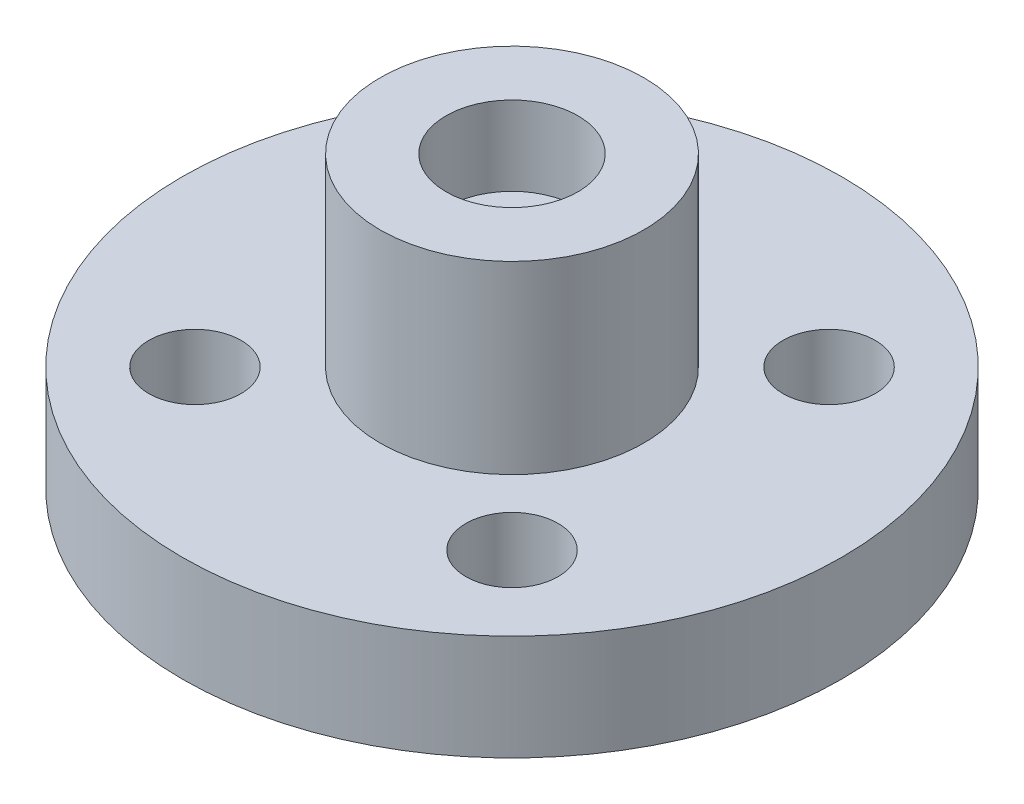
ISO-10303-21;
HEADER;
FILE_DESCRIPTION(('STEP AP214'),'2;1');
FILE_NAME('part.step','',(''),(''),'','','');
FILE_SCHEMA(('AUTOMOTIVE_DESIGN { 1 0 10303 214 1 1 1 1 }'));
ENDSEC;
DATA;
#1=APPLICATION_CONTEXT('core data for automotive mechanical design processes');
#2=APPLICATION_PROTOCOL_DEFINITION('international standard','automotive_design',2000,#1);
#3=PRODUCT_CONTEXT('',#1,'mechanical');
#4=PRODUCT('Part','Part','',(#3));
#5=PRODUCT_RELATED_PRODUCT_CATEGORY('part','',(#4));
#6=PRODUCT_DEFINITION_FORMATION('','',#4);
#7=PRODUCT_DEFINITION_CONTEXT('part definition',#1,'design');
#8=PRODUCT_DEFINITION('design','',#6,#7);
#9=PRODUCT_DEFINITION_SHAPE('','',#8);
#10=(LENGTH_UNIT() NAMED_UNIT(*) SI_UNIT(.MILLI.,.METRE.));
#11=(NAMED_UNIT(*) PLANE_ANGLE_UNIT() SI_UNIT($,.RADIAN.));
#12=(NAMED_UNIT(*) SI_UNIT($,.STERADIAN.) SOLID_ANGLE_UNIT());
#13=UNCERTAINTY_MEASURE_WITH_UNIT(LENGTH_MEASURE(1.E-05),#10,'distance_accuracy_value','');
#14=(GEOMETRIC_REPRESENTATION_CONTEXT(3) GLOBAL_UNCERTAINTY_ASSIGNED_CONTEXT((#13)) GLOBAL_UNIT_ASSIGNED_CONTEXT((#10,
#11,#12)) REPRESENTATION_CONTEXT('',''));
#15=CARTESIAN_POINT('',(0.,0.,0.));
#16=DIRECTION('',(0.,0.,1.));
#17=DIRECTION('',(1.,0.,0.));
#18=AXIS2_PLACEMENT_3D('',#15,#16,#17);
#19=CARTESIAN_POINT('',(0.,4.,0.));
#20=DIRECTION('',(0.,-1.,0.));
#21=DIRECTION('',(0.,0.,-1.));
#22=AXIS2_PLACEMENT_3D('',#19,#20,#21);
#23=CYLINDRICAL_SURFACE('',#22,12.5);
#24=CARTESIAN_POINT('',(0.,4.,0.));
#25=DIRECTION('',(0.,1.,0.));
#26=DIRECTION('',(0.,0.,1.));
#27=AXIS2_PLACEMENT_3D('',#24,#25,#26);
#28=CIRCLE('',#27,12.5);
#29=CARTESIAN_POINT('',(0.,4.,12.5));
#30=VERTEX_POINT('',#29);
#31=EDGE_CURVE('E40',#30,#30,#28,.T.);
#32=ORIENTED_EDGE('',*,*,#31,.F.);
#33=EDGE_LOOP('',(#32));
#34=FACE_BOUND('',#33,.T.);
#35=CARTESIAN_POINT('',(0.,0.,0.));
#36=DIRECTION('',(0.,1.,0.));
#37=DIRECTION('',(0.,0.,1.));
#38=AXIS2_PLACEMENT_3D('',#35,#36,#37);
#39=CIRCLE('',#38,12.5);
#40=CARTESIAN_POINT('',(0.,0.,12.5));
#41=VERTEX_POINT('',#40);
#42=EDGE_CURVE('E44',#41,#41,#39,.T.);
#43=ORIENTED_EDGE('',*,*,#42,.T.);
#44=EDGE_LOOP('',(#43));
#45=FACE_BOUND('',#44,.T.);
#46=ADVANCED_FACE('F34',(#34,#45),#23,.T.);
#47=CARTESIAN_POINT('',(0.,4.,0.));
#48=DIRECTION('',(0.,1.,0.));
#49=DIRECTION('',(0.,0.,1.));
#50=AXIS2_PLACEMENT_3D('',#47,#48,#49);
#51=PLANE('',#50);
#52=CARTESIAN_POINT('',(-6.01040764008568,4.,6.01040764008562));
#53=DIRECTION('',(0.,1.,0.));
#54=DIRECTION('',(0.,0.,1.));
#55=AXIS2_PLACEMENT_3D('',#52,#53,#54);
#56=CIRCLE('',#55,1.75);
#57=CARTESIAN_POINT('',(-6.01040764008568,4.,7.76040764008562));
#58=VERTEX_POINT('',#57);
#59=EDGE_CURVE('E70',#58,#58,#56,.T.);
#60=ORIENTED_EDGE('',*,*,#59,.F.);
#61=EDGE_LOOP('',(#60));
#62=FACE_BOUND('',#61,.T.);
#63=CARTESIAN_POINT('',(6.01040764008565,4.,6.01040764008566));
#64=DIRECTION('',(0.,1.,0.));
#65=DIRECTION('',(0.,0.,1.));
#66=AXIS2_PLACEMENT_3D('',#63,#64,#65);
#67=CIRCLE('',#66,1.75);
#68=CARTESIAN_POINT('',(6.01040764008565,4.,7.76040764008566));
#69=VERTEX_POINT('',#68);
#70=EDGE_CURVE('E69',#69,#69,#67,.T.);
#71=ORIENTED_EDGE('',*,*,#70,.F.);
#72=EDGE_LOOP('',(#71));
#73=FACE_BOUND('',#72,.T.);
#74=CARTESIAN_POINT('',(6.01040764008564,4.,-6.01040764008567));
#75=DIRECTION('',(0.,1.,0.));
#76=DIRECTION('',(0.,0.,1.));
#77=AXIS2_PLACEMENT_3D('',#74,#75,#76);
#78=CIRCLE('',#77,1.75);
#79=CARTESIAN_POINT('',(6.01040764008564,4.,-4.26040764008567));
#80=VERTEX_POINT('',#79);
#81=EDGE_CURVE('E76',#80,#80,#78,.T.);
#82=ORIENTED_EDGE('',*,*,#81,.F.);
#83=EDGE_LOOP('',(#82));
#84=FACE_BOUND('',#83,.T.);
#85=CARTESIAN_POINT('',(-6.01040764008569,4.,-6.01040764008562));
#86=DIRECTION('',(0.,1.,0.));
#87=DIRECTION('',(0.,0.,1.));
#88=AXIS2_PLACEMENT_3D('',#85,#86,#87);
#89=CIRCLE('',#88,1.75);
#90=CARTESIAN_POINT('',(-6.01040764008569,4.,-4.26040764008562));
#91=VERTEX_POINT('',#90);
#92=EDGE_CURVE('E62',#91,#91,#89,.T.);
#93=ORIENTED_EDGE('',*,*,#92,.F.);
#94=EDGE_LOOP('',(#93));
#95=FACE_BOUND('',#94,.T.);
#96=CARTESIAN_POINT('',(0.,4.,0.));
#97=DIRECTION('',(0.,1.,0.));
#98=DIRECTION('',(0.,0.,1.));
#99=AXIS2_PLACEMENT_3D('',#96,#97,#98);
#100=CIRCLE('',#99,5.);
#101=CARTESIAN_POINT('',(0.,4.,5.));
#102=VERTEX_POINT('',#101);
#103=EDGE_CURVE('E51',#102,#102,#100,.T.);
#104=ORIENTED_EDGE('',*,*,#103,.F.);
#105=EDGE_LOOP('',(#104));
#106=FACE_BOUND('',#105,.T.);
#107=ORIENTED_EDGE('',*,*,#31,.T.);
#108=EDGE_LOOP('',(#107));
#109=FACE_BOUND('',#108,.T.);
#110=ADVANCED_FACE('F87',(#62,#73,#84,#95,#106,#109),#51,.T.);
#111=CARTESIAN_POINT('',(0.,0.,0.));
#112=DIRECTION('',(0.,1.,0.));
#113=DIRECTION('',(0.,0.,1.));
#114=AXIS2_PLACEMENT_3D('',#111,#112,#113);
#115=PLANE('',#114);
#116=CARTESIAN_POINT('',(-6.01040764008568,0.,6.01040764008562));
#117=DIRECTION('',(0.,1.,0.));
#118=DIRECTION('',(0.,0.,1.));
#119=AXIS2_PLACEMENT_3D('',#116,#117,#118);
#120=CIRCLE('',#119,1.75);
#121=CARTESIAN_POINT('',(-6.01040764008568,0.,7.76040764008562));
#122=VERTEX_POINT('',#121);
#123=EDGE_CURVE('E66',#122,#122,#120,.F.);
#124=ORIENTED_EDGE('',*,*,#123,.F.);
#125=EDGE_LOOP('',(#124));
#126=FACE_BOUND('',#125,.T.);
#127=CARTESIAN_POINT('',(6.01040764008565,0.,6.01040764008566));
#128=DIRECTION('',(0.,1.,0.));
#129=DIRECTION('',(0.,0.,1.));
#130=AXIS2_PLACEMENT_3D('',#127,#128,#129);
#131=CIRCLE('',#130,1.75);
#132=CARTESIAN_POINT('',(6.01040764008565,0.,7.76040764008566));
#133=VERTEX_POINT('',#132);
#134=EDGE_CURVE('E73',#133,#133,#131,.F.);
#135=ORIENTED_EDGE('',*,*,#134,.F.);
#136=EDGE_LOOP('',(#135));
#137=FACE_BOUND('',#136,.T.);
#138=CARTESIAN_POINT('',(6.01040764008564,0.,-6.01040764008567));
#139=DIRECTION('',(0.,1.,0.));
#140=DIRECTION('',(0.,0.,1.));
#141=AXIS2_PLACEMENT_3D('',#138,#139,#140);
#142=CIRCLE('',#141,1.75);
#143=CARTESIAN_POINT('',(6.01040764008564,0.,-4.26040764008567));
#144=VERTEX_POINT('',#143);
#145=EDGE_CURVE('E65',#144,#144,#142,.F.);
#146=ORIENTED_EDGE('',*,*,#145,.F.);
#147=EDGE_LOOP('',(#146));
#148=FACE_BOUND('',#147,.T.);
#149=CARTESIAN_POINT('',(-6.01040764008569,0.,-6.01040764008562));
#150=DIRECTION('',(0.,1.,0.));
#151=DIRECTION('',(0.,0.,1.));
#152=AXIS2_PLACEMENT_3D('',#149,#150,#151);
#153=CIRCLE('',#152,1.75);
#154=CARTESIAN_POINT('',(-6.01040764008569,0.,-4.26040764008562));
#155=VERTEX_POINT('',#154);
#156=EDGE_CURVE('E59',#155,#155,#153,.F.);
#157=ORIENTED_EDGE('',*,*,#156,.F.);
#158=EDGE_LOOP('',(#157));
#159=FACE_BOUND('',#158,.T.);
#160=ORIENTED_EDGE('',*,*,#42,.F.);
#161=EDGE_LOOP('',(#160));
#162=FACE_BOUND('',#161,.T.);
#163=ADVANCED_FACE('F90',(#126,#137,#148,#159,#162),#115,.F.);
#164=CARTESIAN_POINT('',(0.,11.,0.));
#165=DIRECTION('',(0.,1.,0.));
#166=DIRECTION('',(0.,0.,1.));
#167=AXIS2_PLACEMENT_3D('',#164,#165,#166);
#168=PLANE('',#167);
#169=CARTESIAN_POINT('',(0.,11.,0.));
#170=DIRECTION('',(0.,1.,0.));
#171=DIRECTION('',(0.,0.,1.));
#172=AXIS2_PLACEMENT_3D('',#169,#170,#171);
#173=CIRCLE('',#172,5.);
#174=CARTESIAN_POINT('',(0.,11.,5.));
#175=VERTEX_POINT('',#174);
#176=EDGE_CURVE('E49',#175,#175,#173,.T.);
#177=ORIENTED_EDGE('',*,*,#176,.T.);
#178=EDGE_LOOP('',(#177));
#179=FACE_BOUND('',#178,.T.);
#180=CARTESIAN_POINT('',(0.,11.,0.));
#181=DIRECTION('',(0.,1.,0.));
#182=DIRECTION('',(0.,0.,1.));
#183=AXIS2_PLACEMENT_3D('',#180,#181,#182);
#184=CIRCLE('',#183,2.5);
#185=CARTESIAN_POINT('',(0.,11.,2.5));
#186=VERTEX_POINT('',#185);
#187=EDGE_CURVE('E54',#186,#186,#184,.T.);
#188=ORIENTED_EDGE('',*,*,#187,.F.);
#189=EDGE_LOOP('',(#188));
#190=FACE_BOUND('',#189,.T.);
#191=ADVANCED_FACE('F100',(#179,#190),#168,.T.);
#192=CARTESIAN_POINT('',(0.,11.,0.));
#193=DIRECTION('',(0.,-1.,0.));
#194=DIRECTION('',(0.,0.,-1.));
#195=AXIS2_PLACEMENT_3D('',#192,#193,#194);
#196=CYLINDRICAL_SURFACE('',#195,5.);
#197=ORIENTED_EDGE('',*,*,#176,.F.);
#198=EDGE_LOOP('',(#197));
#199=FACE_BOUND('',#198,.T.);
#200=ORIENTED_EDGE('',*,*,#103,.T.);
#201=EDGE_LOOP('',(#200));
#202=FACE_BOUND('',#201,.T.);
#203=ADVANCED_FACE('F97',(#199,#202),#196,.T.);
#204=CARTESIAN_POINT('',(0.,11.,0.));
#205=DIRECTION('',(0.,-1.,0.));
#206=DIRECTION('',(0.,0.,-1.));
#207=AXIS2_PLACEMENT_3D('',#204,#205,#206);
#208=CYLINDRICAL_SURFACE('',#207,2.5);
#209=CARTESIAN_POINT('',(0.,8.,0.));
#210=DIRECTION('',(0.,1.,0.));
#211=DIRECTION('',(0.,0.,1.));
#212=AXIS2_PLACEMENT_3D('',#209,#210,#211);
#213=CIRCLE('',#212,2.5);
#214=CARTESIAN_POINT('',(0.,8.,2.5));
#215=VERTEX_POINT('',#214);
#216=EDGE_CURVE('E10',#215,#215,#213,.T.);
#217=ORIENTED_EDGE('',*,*,#216,.F.);
#218=EDGE_LOOP('',(#217));
#219=FACE_BOUND('',#218,.T.);
#220=ORIENTED_EDGE('',*,*,#187,.T.);
#221=EDGE_LOOP('',(#220));
#222=FACE_BOUND('',#221,.T.);
#223=ADVANCED_FACE('F99',(#219,#222),#208,.F.);
#224=CARTESIAN_POINT('',(-6.01040764008569,-0.00100000000000013,-6.01040764008562));
#225=DIRECTION('',(0.,1.,0.));
#226=DIRECTION('',(0.,0.,1.));
#227=AXIS2_PLACEMENT_3D('',#224,#225,#226);
#228=CYLINDRICAL_SURFACE('',#227,1.75);
#229=ORIENTED_EDGE('',*,*,#92,.T.);
#230=EDGE_LOOP('',(#229));
#231=FACE_BOUND('',#230,.T.);
#232=ORIENTED_EDGE('',*,*,#156,.T.);
#233=EDGE_LOOP('',(#232));
#234=FACE_BOUND('',#233,.T.);
#235=ADVANCED_FACE('F107',(#231,#234),#228,.F.);
#236=CARTESIAN_POINT('',(6.01040764008564,-0.00100000000000013,-6.01040764008567));
#237=DIRECTION('',(0.,1.,0.));
#238=DIRECTION('',(0.,0.,1.));
#239=AXIS2_PLACEMENT_3D('',#236,#237,#238);
#240=CYLINDRICAL_SURFACE('',#239,1.75);
#241=ORIENTED_EDGE('',*,*,#81,.T.);
#242=EDGE_LOOP('',(#241));
#243=FACE_BOUND('',#242,.T.);
#244=ORIENTED_EDGE('',*,*,#145,.T.);
#245=EDGE_LOOP('',(#244));
#246=FACE_BOUND('',#245,.T.);
#247=ADVANCED_FACE('F84',(#243,#246),#240,.F.);
#248=CARTESIAN_POINT('',(6.01040764008565,-0.00100000000000013,6.01040764008566));
#249=DIRECTION('',(0.,1.,0.));
#250=DIRECTION('',(0.,0.,1.));
#251=AXIS2_PLACEMENT_3D('',#248,#249,#250);
#252=CYLINDRICAL_SURFACE('',#251,1.75);
#253=ORIENTED_EDGE('',*,*,#70,.T.);
#254=EDGE_LOOP('',(#253));
#255=FACE_BOUND('',#254,.T.);
#256=ORIENTED_EDGE('',*,*,#134,.T.);
#257=EDGE_LOOP('',(#256));
#258=FACE_BOUND('',#257,.T.);
#259=ADVANCED_FACE('F138',(#255,#258),#252,.F.);
#260=CARTESIAN_POINT('',(-6.01040764008568,-0.00100000000000013,6.01040764008562));
#261=DIRECTION('',(0.,1.,0.));
#262=DIRECTION('',(0.,0.,1.));
#263=AXIS2_PLACEMENT_3D('',#260,#261,#262);
#264=CYLINDRICAL_SURFACE('',#263,1.75);
#265=ORIENTED_EDGE('',*,*,#59,.T.);
#266=EDGE_LOOP('',(#265));
#267=FACE_BOUND('',#266,.T.);
#268=ORIENTED_EDGE('',*,*,#123,.T.);
#269=EDGE_LOOP('',(#268));
#270=FACE_BOUND('',#269,.T.);
#271=ADVANCED_FACE('F141',(#267,#270),#264,.F.);
#272=CARTESIAN_POINT('',(0.,8.,0.));
#273=DIRECTION('',(0.,1.,0.));
#274=DIRECTION('',(0.,0.,1.));
#275=AXIS2_PLACEMENT_3D('',#272,#273,#274);
#276=PLANE('',#275);
#277=ORIENTED_EDGE('',*,*,#216,.T.);
#278=EDGE_LOOP('',(#277));
#279=FACE_BOUND('',#278,.T.);
#280=ADVANCED_FACE('F144',(#279),#276,.T.);
#281=CLOSED_SHELL('',(#46,#110,#163,#191,#203,#223,#235,#247,#259,#271,#280));
#282=MANIFOLD_SOLID_BREP('B2',#281);
#283=ADVANCED_BREP_SHAPE_REPRESENTATION('',(#18,#282),#14);
#284=SHAPE_DEFINITION_REPRESENTATION(#9,#283);
ENDSEC;
END-ISO-10303-21;
